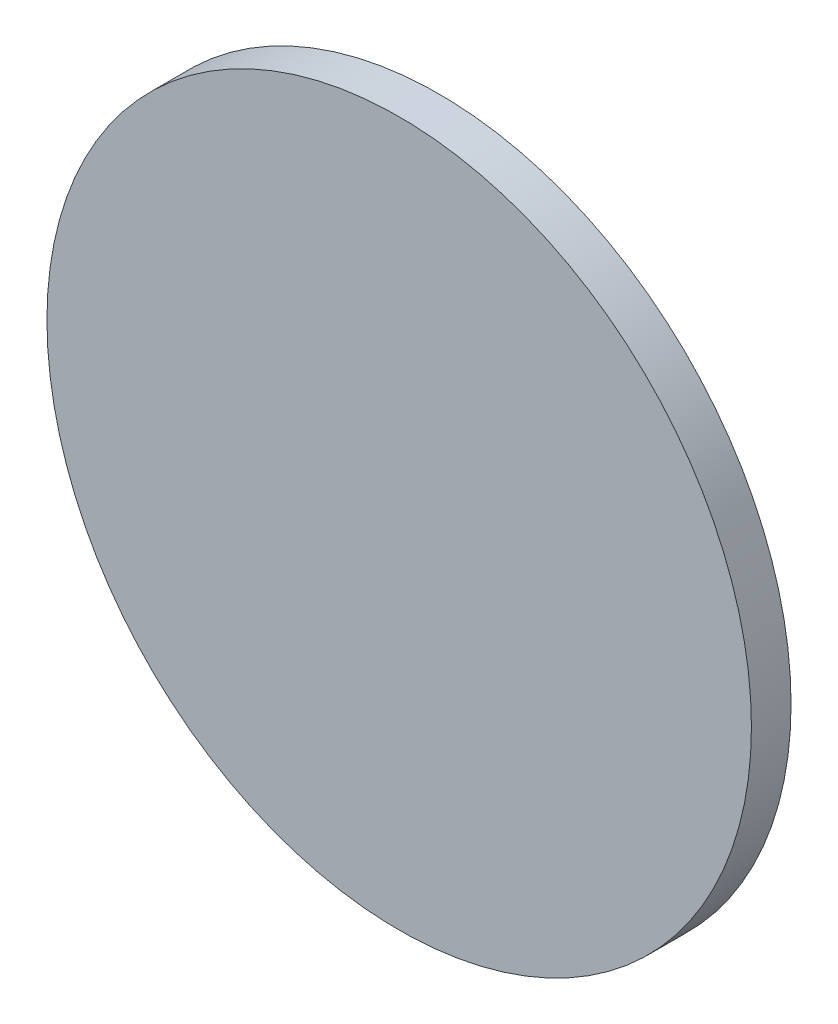
ISO-10303-21;
HEADER;
FILE_DESCRIPTION(('STEP AP214'),'2;1');
FILE_NAME('part.step','',(''),(''),'','','');
FILE_SCHEMA(('AUTOMOTIVE_DESIGN { 1 0 10303 214 1 1 1 1 }'));
ENDSEC;
DATA;
#1=APPLICATION_CONTEXT('core data for automotive mechanical design processes');
#2=APPLICATION_PROTOCOL_DEFINITION('international standard','automotive_design',2000,#1);
#3=PRODUCT_CONTEXT('',#1,'mechanical');
#4=PRODUCT('Part','Part','',(#3));
#5=PRODUCT_RELATED_PRODUCT_CATEGORY('part','',(#4));
#6=PRODUCT_DEFINITION_FORMATION('','',#4);
#7=PRODUCT_DEFINITION_CONTEXT('part definition',#1,'design');
#8=PRODUCT_DEFINITION('design','',#6,#7);
#9=PRODUCT_DEFINITION_SHAPE('','',#8);
#10=(LENGTH_UNIT() NAMED_UNIT(*) SI_UNIT(.MILLI.,.METRE.));
#11=(NAMED_UNIT(*) PLANE_ANGLE_UNIT() SI_UNIT($,.RADIAN.));
#12=(NAMED_UNIT(*) SI_UNIT($,.STERADIAN.) SOLID_ANGLE_UNIT());
#13=UNCERTAINTY_MEASURE_WITH_UNIT(LENGTH_MEASURE(1.E-05),#10,'distance_accuracy_value','');
#14=(GEOMETRIC_REPRESENTATION_CONTEXT(3) GLOBAL_UNCERTAINTY_ASSIGNED_CONTEXT((#13)) GLOBAL_UNIT_ASSIGNED_CONTEXT((#10,
#11,#12)) REPRESENTATION_CONTEXT('',''));
#15=CARTESIAN_POINT('',(0.,0.,0.));
#16=DIRECTION('',(0.,0.,1.));
#17=DIRECTION('',(1.,0.,0.));
#18=AXIS2_PLACEMENT_3D('',#15,#16,#17);
#19=CARTESIAN_POINT('',(12.53916,16.034908666667,0.782015));
#20=DIRECTION('',(0.,0.,1.));
#21=DIRECTION('',(1.,0.,0.));
#22=AXIS2_PLACEMENT_3D('',#19,#20,#21);
#23=PLANE('',#22);
#24=CARTESIAN_POINT('',(12.53916,16.034908666667,0.782015));
#25=DIRECTION('',(0.,0.,1.));
#26=DIRECTION('',(1.,0.,0.));
#27=AXIS2_PLACEMENT_3D('',#24,#25,#26);
#28=CIRCLE('',#27,0.1524);
#29=CARTESIAN_POINT('',(12.69156,16.034908666667,0.782015));
#30=VERTEX_POINT('',#29);
#31=EDGE_CURVE('E18',#30,#30,#28,.F.);
#32=ORIENTED_EDGE('',*,*,#31,.F.);
#33=EDGE_LOOP('',(#32));
#34=FACE_BOUND('',#33,.T.);
#35=ADVANCED_FACE('F15',(#34),#23,.T.);
#36=CARTESIAN_POINT('',(12.53916,16.034908666667,0.76487));
#37=DIRECTION('',(0.,0.,1.));
#38=DIRECTION('',(1.,0.,0.));
#39=AXIS2_PLACEMENT_3D('',#36,#37,#38);
#40=CYLINDRICAL_SURFACE('',#39,0.1524);
#41=ORIENTED_EDGE('',*,*,#31,.T.);
#42=EDGE_LOOP('',(#41));
#43=FACE_BOUND('',#42,.T.);
#44=CARTESIAN_POINT('',(12.53916,16.034908666667,0.76487));
#45=DIRECTION('',(0.,0.,1.));
#46=DIRECTION('',(1.,0.,0.));
#47=AXIS2_PLACEMENT_3D('',#44,#45,#46);
#48=CIRCLE('',#47,0.1524);
#49=CARTESIAN_POINT('',(12.69156,16.034908666667,0.76487));
#50=VERTEX_POINT('',#49);
#51=EDGE_CURVE('E10',#50,#50,#48,.F.);
#52=ORIENTED_EDGE('',*,*,#51,.F.);
#53=EDGE_LOOP('',(#52));
#54=FACE_BOUND('',#53,.T.);
#55=ADVANCED_FACE('F27',(#43,#54),#40,.T.);
#56=CARTESIAN_POINT('',(12.53916,16.034908666667,0.76487));
#57=DIRECTION('',(0.,0.,-1.));
#58=DIRECTION('',(-1.,0.,0.));
#59=AXIS2_PLACEMENT_3D('',#56,#57,#58);
#60=PLANE('',#59);
#61=ORIENTED_EDGE('',*,*,#51,.T.);
#62=EDGE_LOOP('',(#61));
#63=FACE_BOUND('',#62,.T.);
#64=ADVANCED_FACE('F35',(#63),#60,.T.);
#65=CLOSED_SHELL('',(#35,#55,#64));
#66=MANIFOLD_SOLID_BREP('B1',#65);
#67=ADVANCED_BREP_SHAPE_REPRESENTATION('',(#18,#66),#14);
#68=SHAPE_DEFINITION_REPRESENTATION(#9,#67);
ENDSEC;
END-ISO-10303-21;
